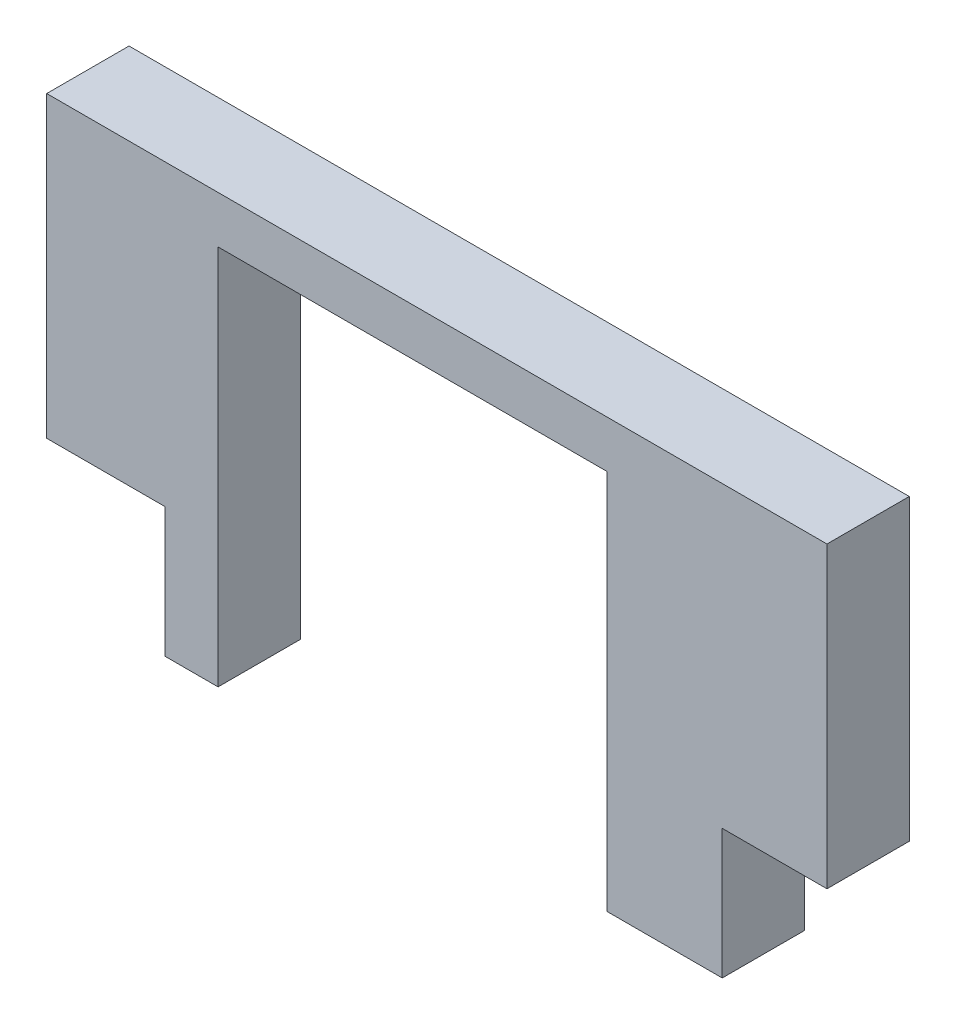
ISO-10303-21;
HEADER;
FILE_DESCRIPTION(('STEP AP214'),'2;1');
FILE_NAME('part.step','',(''),(''),'','','');
FILE_SCHEMA(('AUTOMOTIVE_DESIGN { 1 0 10303 214 1 1 1 1 }'));
ENDSEC;
DATA;
#1=APPLICATION_CONTEXT('core data for automotive mechanical design processes');
#2=APPLICATION_PROTOCOL_DEFINITION('international standard','automotive_design',2000,#1);
#3=PRODUCT_CONTEXT('',#1,'mechanical');
#4=PRODUCT('Part','Part','',(#3));
#5=PRODUCT_RELATED_PRODUCT_CATEGORY('part','',(#4));
#6=PRODUCT_DEFINITION_FORMATION('','',#4);
#7=PRODUCT_DEFINITION_CONTEXT('part definition',#1,'design');
#8=PRODUCT_DEFINITION('design','',#6,#7);
#9=PRODUCT_DEFINITION_SHAPE('','',#8);
#10=(LENGTH_UNIT() NAMED_UNIT(*) SI_UNIT(.MILLI.,.METRE.));
#11=(NAMED_UNIT(*) PLANE_ANGLE_UNIT() SI_UNIT($,.RADIAN.));
#12=(NAMED_UNIT(*) SI_UNIT($,.STERADIAN.) SOLID_ANGLE_UNIT());
#13=UNCERTAINTY_MEASURE_WITH_UNIT(LENGTH_MEASURE(1.E-05),#10,'distance_accuracy_value','');
#14=(GEOMETRIC_REPRESENTATION_CONTEXT(3) GLOBAL_UNCERTAINTY_ASSIGNED_CONTEXT((#13)) GLOBAL_UNIT_ASSIGNED_CONTEXT((#10,
#11,#12)) REPRESENTATION_CONTEXT('',''));
#15=CARTESIAN_POINT('',(0.,0.,0.));
#16=DIRECTION('',(0.,0.,1.));
#17=DIRECTION('',(1.,0.,0.));
#18=AXIS2_PLACEMENT_3D('',#15,#16,#17);
#19=CARTESIAN_POINT('',(0.,16.66,-3.175));
#20=DIRECTION('',(0.,1.,0.));
#21=DIRECTION('',(0.,0.,1.));
#22=AXIS2_PLACEMENT_3D('',#19,#20,#21);
#23=PLANE('',#22);
#24=DIRECTION('',(-1.,0.,0.));
#25=VECTOR('',#24,1.);
#26=CARTESIAN_POINT('',(0.,16.66,0.));
#27=LINE('',#26,#25);
#28=CARTESIAN_POINT('',(30.1,16.66,0.));
#29=VERTEX_POINT('',#28);
#30=CARTESIAN_POINT('',(0.,16.66,0.));
#31=VERTEX_POINT('',#30);
#32=EDGE_CURVE('E203',#29,#31,#27,.T.);
#33=ORIENTED_EDGE('',*,*,#32,.F.);
#34=DIRECTION('',(0.,0.,1.));
#35=VECTOR('',#34,1.);
#36=CARTESIAN_POINT('',(30.1,16.66,-3.175));
#37=LINE('',#36,#35);
#38=CARTESIAN_POINT('',(30.1,16.66,-3.175));
#39=VERTEX_POINT('',#38);
#40=EDGE_CURVE('E50',#39,#29,#37,.T.);
#41=ORIENTED_EDGE('',*,*,#40,.F.);
#42=DIRECTION('',(-1.,0.,0.));
#43=VECTOR('',#42,1.);
#44=CARTESIAN_POINT('',(0.,16.66,-3.175));
#45=LINE('',#44,#43);
#46=CARTESIAN_POINT('',(0.,16.66,-3.175));
#47=VERTEX_POINT('',#46);
#48=EDGE_CURVE('E150',#39,#47,#45,.T.);
#49=ORIENTED_EDGE('',*,*,#48,.T.);
#50=DIRECTION('',(0.,0.,1.));
#51=VECTOR('',#50,1.);
#52=CARTESIAN_POINT('',(0.,16.66,-3.175));
#53=LINE('',#52,#51);
#54=EDGE_CURVE('E11',#47,#31,#53,.T.);
#55=ORIENTED_EDGE('',*,*,#54,.T.);
#56=EDGE_LOOP('',(#33,#41,#49,#55));
#57=FACE_BOUND('',#56,.T.);
#58=ADVANCED_FACE('F39',(#57),#23,.T.);
#59=CARTESIAN_POINT('',(30.1,16.66,-3.175));
#60=DIRECTION('',(1.,0.,0.));
#61=DIRECTION('',(0.,0.,-1.));
#62=AXIS2_PLACEMENT_3D('',#59,#60,#61);
#63=PLANE('',#62);
#64=DIRECTION('',(0.,1.,0.));
#65=VECTOR('',#64,1.);
#66=CARTESIAN_POINT('',(30.1,16.66,0.));
#67=LINE('',#66,#65);
#68=CARTESIAN_POINT('',(30.1,5.13999999999969,0.));
#69=VERTEX_POINT('',#68);
#70=EDGE_CURVE('E134',#69,#29,#67,.T.);
#71=ORIENTED_EDGE('',*,*,#70,.F.);
#72=DIRECTION('',(0.,0.,1.));
#73=VECTOR('',#72,1.);
#74=CARTESIAN_POINT('',(30.1,5.13999999999969,-3.175));
#75=LINE('',#74,#73);
#76=CARTESIAN_POINT('',(30.1,5.13999999999969,-3.175));
#77=VERTEX_POINT('',#76);
#78=EDGE_CURVE('E130',#77,#69,#75,.T.);
#79=ORIENTED_EDGE('',*,*,#78,.F.);
#80=DIRECTION('',(0.,1.,0.));
#81=VECTOR('',#80,1.);
#82=CARTESIAN_POINT('',(30.1,6.34,-3.175));
#83=LINE('',#82,#81);
#84=EDGE_CURVE('E133',#77,#39,#83,.T.);
#85=ORIENTED_EDGE('',*,*,#84,.T.);
#86=ORIENTED_EDGE('',*,*,#40,.T.);
#87=EDGE_LOOP('',(#71,#79,#85,#86));
#88=FACE_BOUND('',#87,.T.);
#89=ADVANCED_FACE('F132',(#88),#63,.T.);
#90=CARTESIAN_POINT('',(30.1,5.13999999999969,-3.175));
#91=DIRECTION('',(0.,-1.,0.));
#92=DIRECTION('',(1.,0.,0.));
#93=AXIS2_PLACEMENT_3D('',#90,#91,#92);
#94=PLANE('',#93);
#95=DIRECTION('',(1.,0.,0.));
#96=VECTOR('',#95,1.);
#97=CARTESIAN_POINT('',(30.1,5.13999999999969,0.));
#98=LINE('',#97,#96);
#99=CARTESIAN_POINT('',(26.0600000000024,5.13999999999968,0.));
#100=VERTEX_POINT('',#99);
#101=EDGE_CURVE('E198',#100,#69,#98,.T.);
#102=ORIENTED_EDGE('',*,*,#101,.F.);
#103=DIRECTION('',(0.,0.,1.));
#104=VECTOR('',#103,1.);
#105=CARTESIAN_POINT('',(26.0600000000024,5.13999999999968,-3.175));
#106=LINE('',#105,#104);
#107=CARTESIAN_POINT('',(26.0600000000024,5.13999999999968,-3.175));
#108=VERTEX_POINT('',#107);
#109=EDGE_CURVE('E140',#108,#100,#106,.T.);
#110=ORIENTED_EDGE('',*,*,#109,.F.);
#111=DIRECTION('',(1.,0.,0.));
#112=VECTOR('',#111,1.);
#113=CARTESIAN_POINT('',(30.1,5.13999999999969,-3.175));
#114=LINE('',#113,#112);
#115=EDGE_CURVE('E147',#108,#77,#114,.T.);
#116=ORIENTED_EDGE('',*,*,#115,.T.);
#117=ORIENTED_EDGE('',*,*,#78,.T.);
#118=EDGE_LOOP('',(#102,#110,#116,#117));
#119=FACE_BOUND('',#118,.T.);
#120=ADVANCED_FACE('F153',(#119),#94,.T.);
#121=CARTESIAN_POINT('',(26.0600000000024,5.13999999999968,-3.175));
#122=DIRECTION('',(1.,0.,0.));
#123=DIRECTION('',(0.,0.,-1.));
#124=AXIS2_PLACEMENT_3D('',#121,#122,#123);
#125=PLANE('',#124);
#126=DIRECTION('',(0.,1.,0.));
#127=VECTOR('',#126,1.);
#128=CARTESIAN_POINT('',(26.0600000000024,5.13999999999968,0.));
#129=LINE('',#128,#127);
#130=CARTESIAN_POINT('',(26.0600000000024,0.139999999999685,0.));
#131=VERTEX_POINT('',#130);
#132=EDGE_CURVE('E194',#131,#100,#129,.T.);
#133=ORIENTED_EDGE('',*,*,#132,.F.);
#134=DIRECTION('',(0.,0.,1.));
#135=VECTOR('',#134,1.);
#136=CARTESIAN_POINT('',(26.0600000000024,0.139999999999685,-3.175));
#137=LINE('',#136,#135);
#138=CARTESIAN_POINT('',(26.0600000000024,0.139999999999685,-3.175));
#139=VERTEX_POINT('',#138);
#140=EDGE_CURVE('E211',#139,#131,#137,.T.);
#141=ORIENTED_EDGE('',*,*,#140,.F.);
#142=DIRECTION('',(0.,1.,0.));
#143=VECTOR('',#142,1.);
#144=CARTESIAN_POINT('',(26.0600000000024,5.13999999999968,-3.175));
#145=LINE('',#144,#143);
#146=EDGE_CURVE('E155',#139,#108,#145,.T.);
#147=ORIENTED_EDGE('',*,*,#146,.T.);
#148=ORIENTED_EDGE('',*,*,#109,.T.);
#149=EDGE_LOOP('',(#133,#141,#147,#148));
#150=FACE_BOUND('',#149,.T.);
#151=ADVANCED_FACE('F255',(#150),#125,.T.);
#152=CARTESIAN_POINT('',(26.0600000000024,0.139999999999685,-3.175));
#153=DIRECTION('',(-4.52267191949557E-13,-1.,0.));
#154=DIRECTION('',(1.,-4.52267191949557E-13,0.));
#155=AXIS2_PLACEMENT_3D('',#152,#153,#154);
#156=PLANE('',#155);
#157=DIRECTION('',(1.,-4.52267191949557E-13,0.));
#158=VECTOR('',#157,1.);
#159=CARTESIAN_POINT('',(26.0600000000024,0.139999999999685,0.));
#160=LINE('',#159,#158);
#161=CARTESIAN_POINT('',(21.61,0.139999999999576,0.));
#162=VERTEX_POINT('',#161);
#163=EDGE_CURVE('E190',#162,#131,#160,.T.);
#164=ORIENTED_EDGE('',*,*,#163,.F.);
#165=DIRECTION('',(0.,0.,1.));
#166=VECTOR('',#165,1.);
#167=CARTESIAN_POINT('',(21.61,0.139999999999576,-3.175));
#168=LINE('',#167,#166);
#169=CARTESIAN_POINT('',(21.61,0.139999999999576,-3.175));
#170=VERTEX_POINT('',#169);
#171=EDGE_CURVE('E214',#170,#162,#168,.T.);
#172=ORIENTED_EDGE('',*,*,#171,.F.);
#173=DIRECTION('',(1.,1.13450915328883E-13,0.));
#174=VECTOR('',#173,1.);
#175=CARTESIAN_POINT('',(21.61,0.139999999999576,-3.175));
#176=LINE('',#175,#174);
#177=EDGE_CURVE('E158',#170,#139,#176,.T.);
#178=ORIENTED_EDGE('',*,*,#177,.T.);
#179=ORIENTED_EDGE('',*,*,#140,.T.);
#180=EDGE_LOOP('',(#164,#172,#178,#179));
#181=FACE_BOUND('',#180,.T.);
#182=ADVANCED_FACE('F258',(#181),#156,.T.);
#183=CARTESIAN_POINT('',(21.61,5.13999999999969,-3.175));
#184=DIRECTION('',(-1.,0.,0.));
#185=DIRECTION('',(0.,-1.,0.));
#186=AXIS2_PLACEMENT_3D('',#183,#184,#185);
#187=PLANE('',#186);
#188=DIRECTION('',(0.,-1.,0.));
#189=VECTOR('',#188,1.);
#190=CARTESIAN_POINT('',(21.61,5.13999999999969,0.));
#191=LINE('',#190,#189);
#192=CARTESIAN_POINT('',(21.61,14.84,0.));
#193=VERTEX_POINT('',#192);
#194=EDGE_CURVE('E186',#193,#162,#191,.T.);
#195=ORIENTED_EDGE('',*,*,#194,.F.);
#196=DIRECTION('',(0.,0.,1.));
#197=VECTOR('',#196,1.);
#198=CARTESIAN_POINT('',(21.61,14.84,-3.175));
#199=LINE('',#198,#197);
#200=CARTESIAN_POINT('',(21.61,14.84,-3.175));
#201=VERTEX_POINT('',#200);
#202=EDGE_CURVE('E218',#201,#193,#199,.T.);
#203=ORIENTED_EDGE('',*,*,#202,.F.);
#204=DIRECTION('',(0.,-1.,0.));
#205=VECTOR('',#204,1.);
#206=CARTESIAN_POINT('',(21.61,14.84,-3.175));
#207=LINE('',#206,#205);
#208=EDGE_CURVE('E406',#201,#170,#207,.T.);
#209=ORIENTED_EDGE('',*,*,#208,.T.);
#210=ORIENTED_EDGE('',*,*,#171,.T.);
#211=EDGE_LOOP('',(#195,#203,#209,#210));
#212=FACE_BOUND('',#211,.T.);
#213=ADVANCED_FACE('F262',(#212),#187,.T.);
#214=CARTESIAN_POINT('',(6.61,14.84,-3.175));
#215=DIRECTION('',(0.,-1.,0.));
#216=DIRECTION('',(0.,0.,-1.));
#217=AXIS2_PLACEMENT_3D('',#214,#215,#216);
#218=PLANE('',#217);
#219=DIRECTION('',(1.,0.,0.));
#220=VECTOR('',#219,1.);
#221=CARTESIAN_POINT('',(6.61,14.84,0.));
#222=LINE('',#221,#220);
#223=CARTESIAN_POINT('',(6.61,14.84,0.));
#224=VERTEX_POINT('',#223);
#225=EDGE_CURVE('E182',#224,#193,#222,.T.);
#226=ORIENTED_EDGE('',*,*,#225,.F.);
#227=DIRECTION('',(0.,0.,1.));
#228=VECTOR('',#227,1.);
#229=CARTESIAN_POINT('',(6.61,14.84,-3.175));
#230=LINE('',#229,#228);
#231=CARTESIAN_POINT('',(6.61,14.84,-3.175));
#232=VERTEX_POINT('',#231);
#233=EDGE_CURVE('E222',#232,#224,#230,.T.);
#234=ORIENTED_EDGE('',*,*,#233,.F.);
#235=DIRECTION('',(1.,0.,0.));
#236=VECTOR('',#235,1.);
#237=CARTESIAN_POINT('',(6.61,14.84,-3.175));
#238=LINE('',#237,#236);
#239=EDGE_CURVE('E401',#232,#201,#238,.T.);
#240=ORIENTED_EDGE('',*,*,#239,.T.);
#241=ORIENTED_EDGE('',*,*,#202,.T.);
#242=EDGE_LOOP('',(#226,#234,#240,#241));
#243=FACE_BOUND('',#242,.T.);
#244=ADVANCED_FACE('F266',(#243),#218,.T.);
#245=CARTESIAN_POINT('',(6.61,6.34,-3.175));
#246=DIRECTION('',(1.,0.,0.));
#247=DIRECTION('',(0.,1.,0.));
#248=AXIS2_PLACEMENT_3D('',#245,#246,#247);
#249=PLANE('',#248);
#250=DIRECTION('',(0.,1.,0.));
#251=VECTOR('',#250,1.);
#252=CARTESIAN_POINT('',(6.61,6.34,0.));
#253=LINE('',#252,#251);
#254=CARTESIAN_POINT('',(6.61000000000001,0.139999999999574,0.));
#255=VERTEX_POINT('',#254);
#256=EDGE_CURVE('E178',#255,#224,#253,.T.);
#257=ORIENTED_EDGE('',*,*,#256,.F.);
#258=DIRECTION('',(0.,0.,1.));
#259=VECTOR('',#258,1.);
#260=CARTESIAN_POINT('',(6.61000000000001,0.139999999999574,-3.175));
#261=LINE('',#260,#259);
#262=CARTESIAN_POINT('',(6.61000000000001,0.139999999999574,-3.175));
#263=VERTEX_POINT('',#262);
#264=EDGE_CURVE('E225',#263,#255,#261,.T.);
#265=ORIENTED_EDGE('',*,*,#264,.F.);
#266=DIRECTION('',(0.,1.,0.));
#267=VECTOR('',#266,1.);
#268=CARTESIAN_POINT('',(6.61000000000001,0.139999999999574,-3.175));
#269=LINE('',#268,#267);
#270=EDGE_CURVE('E396',#263,#232,#269,.T.);
#271=ORIENTED_EDGE('',*,*,#270,.T.);
#272=ORIENTED_EDGE('',*,*,#233,.T.);
#273=EDGE_LOOP('',(#257,#265,#271,#272));
#274=FACE_BOUND('',#273,.T.);
#275=ADVANCED_FACE('F270',(#274),#249,.T.);
#276=CARTESIAN_POINT('',(4.55999997600216,0.139999999999574,-3.175));
#277=DIRECTION('',(0.,-1.,0.));
#278=DIRECTION('',(0.,0.,-1.));
#279=AXIS2_PLACEMENT_3D('',#276,#277,#278);
#280=PLANE('',#279);
#281=DIRECTION('',(1.,0.,0.));
#282=VECTOR('',#281,1.);
#283=CARTESIAN_POINT('',(4.55999997600216,0.139999999999574,0.));
#284=LINE('',#283,#282);
#285=CARTESIAN_POINT('',(4.55999997600216,0.139999999999574,0.));
#286=VERTEX_POINT('',#285);
#287=EDGE_CURVE('E174',#286,#255,#284,.T.);
#288=ORIENTED_EDGE('',*,*,#287,.F.);
#289=DIRECTION('',(0.,0.,1.));
#290=VECTOR('',#289,1.);
#291=CARTESIAN_POINT('',(4.55999997600216,0.139999999999574,-3.175));
#292=LINE('',#291,#290);
#293=CARTESIAN_POINT('',(4.55999997600216,0.139999999999574,-3.175));
#294=VERTEX_POINT('',#293);
#295=EDGE_CURVE('E229',#294,#286,#292,.T.);
#296=ORIENTED_EDGE('',*,*,#295,.F.);
#297=DIRECTION('',(1.,0.,0.));
#298=VECTOR('',#297,1.);
#299=CARTESIAN_POINT('',(4.55999997600216,0.139999999999574,-3.175));
#300=LINE('',#299,#298);
#301=EDGE_CURVE('E394',#294,#263,#300,.T.);
#302=ORIENTED_EDGE('',*,*,#301,.T.);
#303=ORIENTED_EDGE('',*,*,#264,.T.);
#304=EDGE_LOOP('',(#288,#296,#302,#303));
#305=FACE_BOUND('',#304,.T.);
#306=ADVANCED_FACE('F274',(#305),#280,.T.);
#307=CARTESIAN_POINT('',(4.55999997600225,5.13999999999957,-3.175));
#308=DIRECTION('',(-1.,0.,0.));
#309=DIRECTION('',(0.,-1.,0.));
#310=AXIS2_PLACEMENT_3D('',#307,#308,#309);
#311=PLANE('',#310);
#312=DIRECTION('',(0.,-1.,0.));
#313=VECTOR('',#312,1.);
#314=CARTESIAN_POINT('',(4.55999997600225,5.13999999999957,0.));
#315=LINE('',#314,#313);
#316=CARTESIAN_POINT('',(4.55999997600225,5.13999999999957,0.));
#317=VERTEX_POINT('',#316);
#318=EDGE_CURVE('E170',#317,#286,#315,.T.);
#319=ORIENTED_EDGE('',*,*,#318,.F.);
#320=DIRECTION('',(0.,0.,1.));
#321=VECTOR('',#320,1.);
#322=CARTESIAN_POINT('',(4.55999997600225,5.13999999999957,-3.175));
#323=LINE('',#322,#321);
#324=CARTESIAN_POINT('',(4.55999997600225,5.13999999999957,-3.175));
#325=VERTEX_POINT('',#324);
#326=EDGE_CURVE('E231',#325,#317,#323,.T.);
#327=ORIENTED_EDGE('',*,*,#326,.F.);
#328=DIRECTION('',(0.,-1.,0.));
#329=VECTOR('',#328,1.);
#330=CARTESIAN_POINT('',(4.55999997600225,5.13999999999957,-3.175));
#331=LINE('',#330,#329);
#332=EDGE_CURVE('E408',#325,#294,#331,.T.);
#333=ORIENTED_EDGE('',*,*,#332,.T.);
#334=ORIENTED_EDGE('',*,*,#295,.T.);
#335=EDGE_LOOP('',(#319,#327,#333,#334));
#336=FACE_BOUND('',#335,.T.);
#337=ADVANCED_FACE('F278',(#336),#311,.T.);
#338=CARTESIAN_POINT('',(0.,5.14,-3.175));
#339=DIRECTION('',(0.,-1.,0.));
#340=DIRECTION('',(1.,0.,0.));
#341=AXIS2_PLACEMENT_3D('',#338,#339,#340);
#342=PLANE('',#341);
#343=DIRECTION('',(1.,0.,0.));
#344=VECTOR('',#343,1.);
#345=CARTESIAN_POINT('',(0.,5.14,0.));
#346=LINE('',#345,#344);
#347=CARTESIAN_POINT('',(0.,5.14,0.));
#348=VERTEX_POINT('',#347);
#349=EDGE_CURVE('E166',#348,#317,#346,.T.);
#350=ORIENTED_EDGE('',*,*,#349,.F.);
#351=DIRECTION('',(0.,0.,1.));
#352=VECTOR('',#351,1.);
#353=CARTESIAN_POINT('',(0.,5.14,-3.175));
#354=LINE('',#353,#352);
#355=CARTESIAN_POINT('',(0.,5.14,-3.175));
#356=VERTEX_POINT('',#355);
#357=EDGE_CURVE('E43',#356,#348,#354,.T.);
#358=ORIENTED_EDGE('',*,*,#357,.F.);
#359=DIRECTION('',(1.,0.,0.));
#360=VECTOR('',#359,1.);
#361=CARTESIAN_POINT('',(0.,5.14,-3.175));
#362=LINE('',#361,#360);
#363=EDGE_CURVE('E421',#356,#325,#362,.T.);
#364=ORIENTED_EDGE('',*,*,#363,.T.);
#365=ORIENTED_EDGE('',*,*,#326,.T.);
#366=EDGE_LOOP('',(#350,#358,#364,#365));
#367=FACE_BOUND('',#366,.T.);
#368=ADVANCED_FACE('F239',(#367),#342,.T.);
#369=CARTESIAN_POINT('',(0.,6.34,-3.175));
#370=DIRECTION('',(-1.,0.,0.));
#371=DIRECTION('',(0.,0.,1.));
#372=AXIS2_PLACEMENT_3D('',#369,#370,#371);
#373=PLANE('',#372);
#374=DIRECTION('',(0.,-1.,0.));
#375=VECTOR('',#374,1.);
#376=CARTESIAN_POINT('',(0.,6.34,0.));
#377=LINE('',#376,#375);
#378=EDGE_CURVE('E100',#31,#348,#377,.T.);
#379=ORIENTED_EDGE('',*,*,#378,.F.);
#380=ORIENTED_EDGE('',*,*,#54,.F.);
#381=DIRECTION('',(0.,-1.,0.));
#382=VECTOR('',#381,1.);
#383=CARTESIAN_POINT('',(0.,16.66,-3.175));
#384=LINE('',#383,#382);
#385=EDGE_CURVE('E103',#47,#356,#384,.T.);
#386=ORIENTED_EDGE('',*,*,#385,.T.);
#387=ORIENTED_EDGE('',*,*,#357,.T.);
#388=EDGE_LOOP('',(#379,#380,#386,#387));
#389=FACE_BOUND('',#388,.T.);
#390=ADVANCED_FACE('F41',(#389),#373,.T.);
#391=CARTESIAN_POINT('',(0.,0.,-3.175));
#392=DIRECTION('',(0.,0.,1.));
#393=DIRECTION('',(1.,0.,0.));
#394=AXIS2_PLACEMENT_3D('',#391,#392,#393);
#395=PLANE('',#394);
#396=ORIENTED_EDGE('',*,*,#385,.F.);
#397=ORIENTED_EDGE('',*,*,#48,.F.);
#398=ORIENTED_EDGE('',*,*,#84,.F.);
#399=ORIENTED_EDGE('',*,*,#115,.F.);
#400=ORIENTED_EDGE('',*,*,#146,.F.);
#401=ORIENTED_EDGE('',*,*,#177,.F.);
#402=ORIENTED_EDGE('',*,*,#208,.F.);
#403=ORIENTED_EDGE('',*,*,#239,.F.);
#404=ORIENTED_EDGE('',*,*,#270,.F.);
#405=ORIENTED_EDGE('',*,*,#301,.F.);
#406=ORIENTED_EDGE('',*,*,#332,.F.);
#407=ORIENTED_EDGE('',*,*,#363,.F.);
#408=EDGE_LOOP('',(#396,#397,#398,#399,#400,#401,#402,#403,#404,#405,#406,#407));
#409=FACE_BOUND('',#408,.T.);
#410=ADVANCED_FACE('F145',(#409),#395,.F.);
#411=CARTESIAN_POINT('',(0.,0.,0.));
#412=DIRECTION('',(0.,0.,1.));
#413=DIRECTION('',(1.,0.,0.));
#414=AXIS2_PLACEMENT_3D('',#411,#412,#413);
#415=PLANE('',#414);
#416=ORIENTED_EDGE('',*,*,#32,.T.);
#417=ORIENTED_EDGE('',*,*,#378,.T.);
#418=ORIENTED_EDGE('',*,*,#349,.T.);
#419=ORIENTED_EDGE('',*,*,#318,.T.);
#420=ORIENTED_EDGE('',*,*,#287,.T.);
#421=ORIENTED_EDGE('',*,*,#256,.T.);
#422=ORIENTED_EDGE('',*,*,#225,.T.);
#423=ORIENTED_EDGE('',*,*,#194,.T.);
#424=ORIENTED_EDGE('',*,*,#163,.T.);
#425=ORIENTED_EDGE('',*,*,#132,.T.);
#426=ORIENTED_EDGE('',*,*,#101,.T.);
#427=ORIENTED_EDGE('',*,*,#70,.T.);
#428=EDGE_LOOP('',(#416,#417,#418,#419,#420,#421,#422,#423,#424,#425,#426,#427));
#429=FACE_BOUND('',#428,.T.);
#430=ADVANCED_FACE('F241',(#429),#415,.T.);
#431=CLOSED_SHELL('',(#58,#89,#120,#151,#182,#213,#244,#275,#306,#337,#368,#390,#410,#430));
#432=MANIFOLD_SOLID_BREP('B2',#431);
#433=ADVANCED_BREP_SHAPE_REPRESENTATION('',(#18,#432),#14);
#434=SHAPE_DEFINITION_REPRESENTATION(#9,#433);
ENDSEC;
END-ISO-10303-21;
